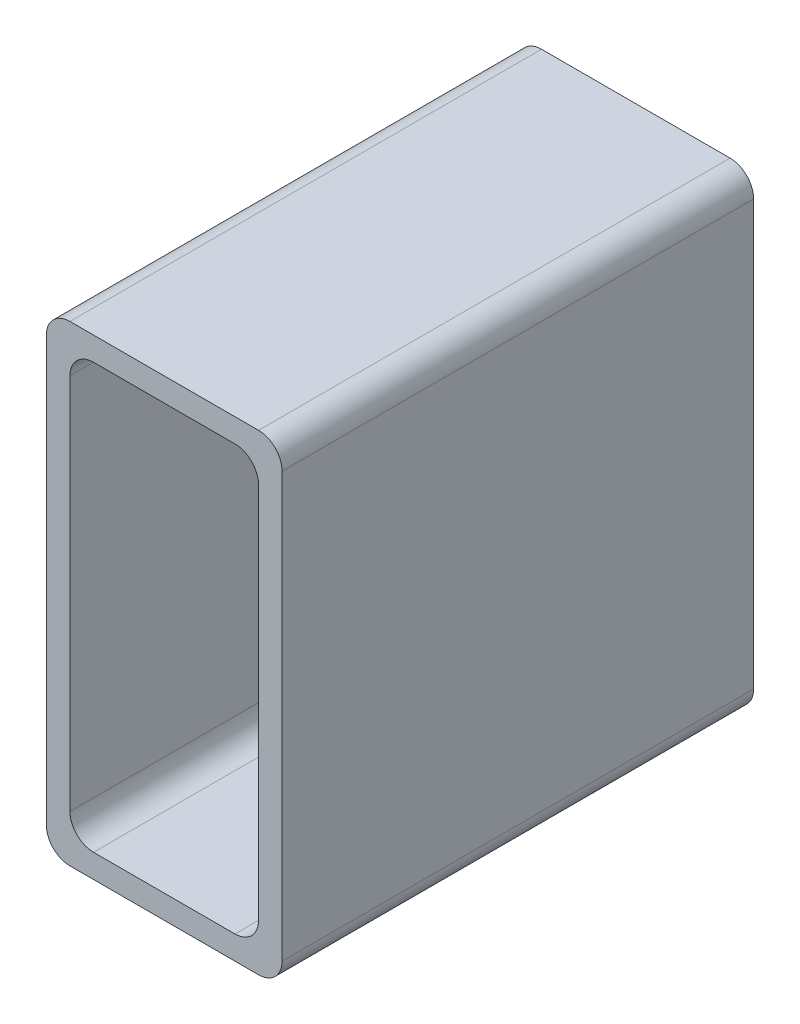
ISO-10303-21;
HEADER;
FILE_DESCRIPTION(('STEP AP214'),'2;1');
FILE_NAME('part.step','',(''),(''),'','','');
FILE_SCHEMA(('AUTOMOTIVE_DESIGN { 1 0 10303 214 1 1 1 1 }'));
ENDSEC;
DATA;
#1=APPLICATION_CONTEXT('core data for automotive mechanical design processes');
#2=APPLICATION_PROTOCOL_DEFINITION('international standard','automotive_design',2000,#1);
#3=PRODUCT_CONTEXT('',#1,'mechanical');
#4=PRODUCT('Part','Part','',(#3));
#5=PRODUCT_RELATED_PRODUCT_CATEGORY('part','',(#4));
#6=PRODUCT_DEFINITION_FORMATION('','',#4);
#7=PRODUCT_DEFINITION_CONTEXT('part definition',#1,'design');
#8=PRODUCT_DEFINITION('design','',#6,#7);
#9=PRODUCT_DEFINITION_SHAPE('','',#8);
#10=(LENGTH_UNIT() NAMED_UNIT(*) SI_UNIT(.MILLI.,.METRE.));
#11=(NAMED_UNIT(*) PLANE_ANGLE_UNIT() SI_UNIT($,.RADIAN.));
#12=(NAMED_UNIT(*) SI_UNIT($,.STERADIAN.) SOLID_ANGLE_UNIT());
#13=UNCERTAINTY_MEASURE_WITH_UNIT(LENGTH_MEASURE(1.E-05),#10,'distance_accuracy_value','');
#14=(GEOMETRIC_REPRESENTATION_CONTEXT(3) GLOBAL_UNCERTAINTY_ASSIGNED_CONTEXT((#13)) GLOBAL_UNIT_ASSIGNED_CONTEXT((#10,
#11,#12)) REPRESENTATION_CONTEXT('',''));
#15=CARTESIAN_POINT('',(0.,0.,0.));
#16=DIRECTION('',(0.,0.,1.));
#17=DIRECTION('',(1.,0.,0.));
#18=AXIS2_PLACEMENT_3D('',#15,#16,#17);
#19=CARTESIAN_POINT('',(12.,-27.,60.));
#20=DIRECTION('',(0.,0.,1.));
#21=DIRECTION('',(1.,0.,0.));
#22=AXIS2_PLACEMENT_3D('',#19,#20,#21);
#23=PLANE('',#22);
#24=CARTESIAN_POINT('',(12.,-27.,60.));
#25=DIRECTION('',(0.,0.,1.));
#26=DIRECTION('',(1.,0.,0.));
#27=AXIS2_PLACEMENT_3D('',#24,#25,#26);
#28=CIRCLE('',#27,3.);
#29=CARTESIAN_POINT('',(12.,-30.,60.));
#30=VERTEX_POINT('',#29);
#31=CARTESIAN_POINT('',(15.,-27.,60.));
#32=VERTEX_POINT('',#31);
#33=EDGE_CURVE('E157',#30,#32,#28,.T.);
#34=ORIENTED_EDGE('',*,*,#33,.T.);
#35=DIRECTION('',(0.,1.,0.));
#36=VECTOR('',#35,1.);
#37=CARTESIAN_POINT('',(15.,-27.,60.));
#38=LINE('',#37,#36);
#39=CARTESIAN_POINT('',(15.,27.,60.));
#40=VERTEX_POINT('',#39);
#41=EDGE_CURVE('E146',#32,#40,#38,.T.);
#42=ORIENTED_EDGE('',*,*,#41,.T.);
#43=CARTESIAN_POINT('',(12.,27.,60.));
#44=DIRECTION('',(0.,0.,1.));
#45=DIRECTION('',(-1.,0.,0.));
#46=AXIS2_PLACEMENT_3D('',#43,#44,#45);
#47=CIRCLE('',#46,3.);
#48=CARTESIAN_POINT('',(12.,30.,60.));
#49=VERTEX_POINT('',#48);
#50=EDGE_CURVE('E156',#40,#49,#47,.T.);
#51=ORIENTED_EDGE('',*,*,#50,.T.);
#52=DIRECTION('',(-1.,0.,0.));
#53=VECTOR('',#52,1.);
#54=CARTESIAN_POINT('',(-12.,30.,60.));
#55=LINE('',#54,#53);
#56=CARTESIAN_POINT('',(-12.,30.,60.));
#57=VERTEX_POINT('',#56);
#58=EDGE_CURVE('E241',#49,#57,#55,.T.);
#59=ORIENTED_EDGE('',*,*,#58,.T.);
#60=CARTESIAN_POINT('',(-12.,27.,60.));
#61=DIRECTION('',(0.,0.,1.));
#62=DIRECTION('',(-1.,0.,0.));
#63=AXIS2_PLACEMENT_3D('',#60,#61,#62);
#64=CIRCLE('',#63,3.);
#65=CARTESIAN_POINT('',(-15.,27.,60.));
#66=VERTEX_POINT('',#65);
#67=EDGE_CURVE('E243',#57,#66,#64,.T.);
#68=ORIENTED_EDGE('',*,*,#67,.T.);
#69=DIRECTION('',(0.,-1.,0.));
#70=VECTOR('',#69,1.);
#71=CARTESIAN_POINT('',(-15.,-27.,60.));
#72=LINE('',#71,#70);
#73=CARTESIAN_POINT('',(-15.,-27.,60.));
#74=VERTEX_POINT('',#73);
#75=EDGE_CURVE('E245',#66,#74,#72,.T.);
#76=ORIENTED_EDGE('',*,*,#75,.T.);
#77=CARTESIAN_POINT('',(-12.,-27.,60.));
#78=DIRECTION('',(0.,0.,1.));
#79=DIRECTION('',(-1.,0.,0.));
#80=AXIS2_PLACEMENT_3D('',#77,#78,#79);
#81=CIRCLE('',#80,3.);
#82=CARTESIAN_POINT('',(-12.,-30.,60.));
#83=VERTEX_POINT('',#82);
#84=EDGE_CURVE('E247',#74,#83,#81,.T.);
#85=ORIENTED_EDGE('',*,*,#84,.T.);
#86=DIRECTION('',(1.,0.,0.));
#87=VECTOR('',#86,1.);
#88=CARTESIAN_POINT('',(-12.,-30.,60.));
#89=LINE('',#88,#87);
#90=EDGE_CURVE('E161',#83,#30,#89,.T.);
#91=ORIENTED_EDGE('',*,*,#90,.T.);
#92=EDGE_LOOP('',(#34,#42,#51,#59,#68,#76,#85,#91));
#93=FACE_BOUND('',#92,.T.);
#94=DIRECTION('',(1.,0.,0.));
#95=VECTOR('',#94,1.);
#96=CARTESIAN_POINT('',(-12.,-27.,60.));
#97=LINE('',#96,#95);
#98=CARTESIAN_POINT('',(-8.99999999999998,-27.,60.));
#99=VERTEX_POINT('',#98);
#100=CARTESIAN_POINT('',(9.,-27.,60.));
#101=VERTEX_POINT('',#100);
#102=EDGE_CURVE('E225',#99,#101,#97,.T.);
#103=ORIENTED_EDGE('',*,*,#102,.F.);
#104=CARTESIAN_POINT('',(-8.99999999999998,-24.,60.));
#105=DIRECTION('',(0.,0.,1.));
#106=DIRECTION('',(1.,0.,0.));
#107=AXIS2_PLACEMENT_3D('',#104,#105,#106);
#108=CIRCLE('',#107,3.);
#109=CARTESIAN_POINT('',(-12.,-24.,60.));
#110=VERTEX_POINT('',#109);
#111=EDGE_CURVE('E11',#99,#110,#108,.F.);
#112=ORIENTED_EDGE('',*,*,#111,.T.);
#113=DIRECTION('',(0.,-1.,0.));
#114=VECTOR('',#113,1.);
#115=CARTESIAN_POINT('',(-12.,-27.,60.));
#116=LINE('',#115,#114);
#117=CARTESIAN_POINT('',(-12.,24.,60.));
#118=VERTEX_POINT('',#117);
#119=EDGE_CURVE('E223',#118,#110,#116,.T.);
#120=ORIENTED_EDGE('',*,*,#119,.F.);
#121=CARTESIAN_POINT('',(-9.,24.,60.));
#122=DIRECTION('',(0.,0.,1.));
#123=DIRECTION('',(1.,0.,0.));
#124=AXIS2_PLACEMENT_3D('',#121,#122,#123);
#125=CIRCLE('',#124,3.);
#126=CARTESIAN_POINT('',(-9.,27.,60.));
#127=VERTEX_POINT('',#126);
#128=EDGE_CURVE('E204',#118,#127,#125,.F.);
#129=ORIENTED_EDGE('',*,*,#128,.T.);
#130=DIRECTION('',(-1.,0.,0.));
#131=VECTOR('',#130,1.);
#132=CARTESIAN_POINT('',(-12.,27.,60.));
#133=LINE('',#132,#131);
#134=CARTESIAN_POINT('',(8.99999999999998,27.,60.));
#135=VERTEX_POINT('',#134);
#136=EDGE_CURVE('E234',#135,#127,#133,.T.);
#137=ORIENTED_EDGE('',*,*,#136,.F.);
#138=CARTESIAN_POINT('',(8.99999999999998,24.,60.));
#139=DIRECTION('',(0.,0.,1.));
#140=DIRECTION('',(1.,0.,0.));
#141=AXIS2_PLACEMENT_3D('',#138,#139,#140);
#142=CIRCLE('',#141,3.);
#143=CARTESIAN_POINT('',(12.,24.,60.));
#144=VERTEX_POINT('',#143);
#145=EDGE_CURVE('E200',#135,#144,#142,.F.);
#146=ORIENTED_EDGE('',*,*,#145,.T.);
#147=DIRECTION('',(0.,1.,0.));
#148=VECTOR('',#147,1.);
#149=CARTESIAN_POINT('',(12.,-27.,60.));
#150=LINE('',#149,#148);
#151=CARTESIAN_POINT('',(12.,-24.,60.));
#152=VERTEX_POINT('',#151);
#153=EDGE_CURVE('E228',#152,#144,#150,.T.);
#154=ORIENTED_EDGE('',*,*,#153,.F.);
#155=CARTESIAN_POINT('',(9.,-24.,60.));
#156=DIRECTION('',(0.,0.,1.));
#157=DIRECTION('',(1.,0.,0.));
#158=AXIS2_PLACEMENT_3D('',#155,#156,#157);
#159=CIRCLE('',#158,3.);
#160=EDGE_CURVE('E196',#152,#101,#159,.F.);
#161=ORIENTED_EDGE('',*,*,#160,.T.);
#162=EDGE_LOOP('',(#103,#112,#120,#129,#137,#146,#154,#161));
#163=FACE_BOUND('',#162,.T.);
#164=ADVANCED_FACE('F33',(#93,#163),#23,.T.);
#165=CARTESIAN_POINT('',(12.,-27.,0.));
#166=DIRECTION('',(0.,0.,1.));
#167=DIRECTION('',(1.,0.,0.));
#168=AXIS2_PLACEMENT_3D('',#165,#166,#167);
#169=PLANE('',#168);
#170=CARTESIAN_POINT('',(12.,-27.,0.));
#171=DIRECTION('',(0.,0.,1.));
#172=DIRECTION('',(1.,0.,0.));
#173=AXIS2_PLACEMENT_3D('',#170,#171,#172);
#174=CIRCLE('',#173,3.);
#175=CARTESIAN_POINT('',(12.,-30.,0.));
#176=VERTEX_POINT('',#175);
#177=CARTESIAN_POINT('',(15.,-27.,0.));
#178=VERTEX_POINT('',#177);
#179=EDGE_CURVE('E169',#176,#178,#174,.T.);
#180=ORIENTED_EDGE('',*,*,#179,.F.);
#181=DIRECTION('',(1.,0.,0.));
#182=VECTOR('',#181,1.);
#183=CARTESIAN_POINT('',(-12.,-30.,0.));
#184=LINE('',#183,#182);
#185=CARTESIAN_POINT('',(-12.,-30.,0.));
#186=VERTEX_POINT('',#185);
#187=EDGE_CURVE('E165',#186,#176,#184,.T.);
#188=ORIENTED_EDGE('',*,*,#187,.F.);
#189=CARTESIAN_POINT('',(-12.,-27.,0.));
#190=DIRECTION('',(0.,0.,1.));
#191=DIRECTION('',(-1.,0.,0.));
#192=AXIS2_PLACEMENT_3D('',#189,#190,#191);
#193=CIRCLE('',#192,3.);
#194=CARTESIAN_POINT('',(-15.,-27.,0.));
#195=VERTEX_POINT('',#194);
#196=EDGE_CURVE('E262',#195,#186,#193,.T.);
#197=ORIENTED_EDGE('',*,*,#196,.F.);
#198=DIRECTION('',(0.,-1.,0.));
#199=VECTOR('',#198,1.);
#200=CARTESIAN_POINT('',(-15.,-27.,0.));
#201=LINE('',#200,#199);
#202=CARTESIAN_POINT('',(-15.,27.,0.));
#203=VERTEX_POINT('',#202);
#204=EDGE_CURVE('E260',#203,#195,#201,.T.);
#205=ORIENTED_EDGE('',*,*,#204,.F.);
#206=CARTESIAN_POINT('',(-12.,27.,0.));
#207=DIRECTION('',(0.,0.,1.));
#208=DIRECTION('',(-1.,0.,0.));
#209=AXIS2_PLACEMENT_3D('',#206,#207,#208);
#210=CIRCLE('',#209,3.);
#211=CARTESIAN_POINT('',(-12.,30.,0.));
#212=VERTEX_POINT('',#211);
#213=EDGE_CURVE('E258',#212,#203,#210,.T.);
#214=ORIENTED_EDGE('',*,*,#213,.F.);
#215=DIRECTION('',(-1.,0.,0.));
#216=VECTOR('',#215,1.);
#217=CARTESIAN_POINT('',(-12.,30.,0.));
#218=LINE('',#217,#216);
#219=CARTESIAN_POINT('',(12.,30.,0.));
#220=VERTEX_POINT('',#219);
#221=EDGE_CURVE('E256',#220,#212,#218,.T.);
#222=ORIENTED_EDGE('',*,*,#221,.F.);
#223=CARTESIAN_POINT('',(12.,27.,0.));
#224=DIRECTION('',(0.,0.,1.));
#225=DIRECTION('',(-1.,0.,0.));
#226=AXIS2_PLACEMENT_3D('',#223,#224,#225);
#227=CIRCLE('',#226,3.);
#228=CARTESIAN_POINT('',(15.,27.,0.));
#229=VERTEX_POINT('',#228);
#230=EDGE_CURVE('E254',#229,#220,#227,.T.);
#231=ORIENTED_EDGE('',*,*,#230,.F.);
#232=DIRECTION('',(0.,1.,0.));
#233=VECTOR('',#232,1.);
#234=CARTESIAN_POINT('',(15.,-27.,0.));
#235=LINE('',#234,#233);
#236=EDGE_CURVE('E252',#178,#229,#235,.T.);
#237=ORIENTED_EDGE('',*,*,#236,.F.);
#238=EDGE_LOOP('',(#180,#188,#197,#205,#214,#222,#231,#237));
#239=FACE_BOUND('',#238,.T.);
#240=DIRECTION('',(-1.,0.,0.));
#241=VECTOR('',#240,1.);
#242=CARTESIAN_POINT('',(-12.,27.,0.));
#243=LINE('',#242,#241);
#244=CARTESIAN_POINT('',(8.99999999999998,27.,0.));
#245=VERTEX_POINT('',#244);
#246=CARTESIAN_POINT('',(-9.,27.,0.));
#247=VERTEX_POINT('',#246);
#248=EDGE_CURVE('E226',#245,#247,#243,.T.);
#249=ORIENTED_EDGE('',*,*,#248,.T.);
#250=CARTESIAN_POINT('',(-9.,24.,0.));
#251=DIRECTION('',(0.,0.,1.));
#252=DIRECTION('',(1.,0.,0.));
#253=AXIS2_PLACEMENT_3D('',#250,#251,#252);
#254=CIRCLE('',#253,3.);
#255=CARTESIAN_POINT('',(-12.,24.,0.));
#256=VERTEX_POINT('',#255);
#257=EDGE_CURVE('E202',#247,#256,#254,.T.);
#258=ORIENTED_EDGE('',*,*,#257,.T.);
#259=DIRECTION('',(0.,-1.,0.));
#260=VECTOR('',#259,1.);
#261=CARTESIAN_POINT('',(-12.,-27.,0.));
#262=LINE('',#261,#260);
#263=CARTESIAN_POINT('',(-12.,-24.,0.));
#264=VERTEX_POINT('',#263);
#265=EDGE_CURVE('E212',#256,#264,#262,.T.);
#266=ORIENTED_EDGE('',*,*,#265,.T.);
#267=CARTESIAN_POINT('',(-8.99999999999998,-24.,0.));
#268=DIRECTION('',(0.,0.,1.));
#269=DIRECTION('',(1.,0.,0.));
#270=AXIS2_PLACEMENT_3D('',#267,#268,#269);
#271=CIRCLE('',#270,3.);
#272=CARTESIAN_POINT('',(-8.99999999999998,-27.,0.));
#273=VERTEX_POINT('',#272);
#274=EDGE_CURVE('E41',#264,#273,#271,.T.);
#275=ORIENTED_EDGE('',*,*,#274,.T.);
#276=DIRECTION('',(1.,0.,0.));
#277=VECTOR('',#276,1.);
#278=CARTESIAN_POINT('',(-12.,-27.,0.));
#279=LINE('',#278,#277);
#280=CARTESIAN_POINT('',(9.,-27.,0.));
#281=VERTEX_POINT('',#280);
#282=EDGE_CURVE('E211',#273,#281,#279,.T.);
#283=ORIENTED_EDGE('',*,*,#282,.T.);
#284=CARTESIAN_POINT('',(9.,-24.,0.));
#285=DIRECTION('',(0.,0.,1.));
#286=DIRECTION('',(1.,0.,0.));
#287=AXIS2_PLACEMENT_3D('',#284,#285,#286);
#288=CIRCLE('',#287,3.);
#289=CARTESIAN_POINT('',(12.,-24.,0.));
#290=VERTEX_POINT('',#289);
#291=EDGE_CURVE('E194',#281,#290,#288,.T.);
#292=ORIENTED_EDGE('',*,*,#291,.T.);
#293=DIRECTION('',(0.,1.,0.));
#294=VECTOR('',#293,1.);
#295=CARTESIAN_POINT('',(12.,-27.,0.));
#296=LINE('',#295,#294);
#297=CARTESIAN_POINT('',(12.,24.,0.));
#298=VERTEX_POINT('',#297);
#299=EDGE_CURVE('E220',#290,#298,#296,.T.);
#300=ORIENTED_EDGE('',*,*,#299,.T.);
#301=CARTESIAN_POINT('',(8.99999999999998,24.,0.));
#302=DIRECTION('',(0.,0.,1.));
#303=DIRECTION('',(1.,0.,0.));
#304=AXIS2_PLACEMENT_3D('',#301,#302,#303);
#305=CIRCLE('',#304,3.);
#306=EDGE_CURVE('E198',#298,#245,#305,.T.);
#307=ORIENTED_EDGE('',*,*,#306,.T.);
#308=EDGE_LOOP('',(#249,#258,#266,#275,#283,#292,#300,#307));
#309=FACE_BOUND('',#308,.T.);
#310=ADVANCED_FACE('F210',(#239,#309),#169,.F.);
#311=CARTESIAN_POINT('',(12.,-27.,60.));
#312=DIRECTION('',(0.,0.,-1.));
#313=DIRECTION('',(-1.,0.,0.));
#314=AXIS2_PLACEMENT_3D('',#311,#312,#313);
#315=CYLINDRICAL_SURFACE('',#314,3.);
#316=ORIENTED_EDGE('',*,*,#179,.T.);
#317=DIRECTION('',(0.,0.,-1.));
#318=VECTOR('',#317,1.);
#319=CARTESIAN_POINT('',(15.,-27.,60.));
#320=LINE('',#319,#318);
#321=EDGE_CURVE('E150',#32,#178,#320,.T.);
#322=ORIENTED_EDGE('',*,*,#321,.F.);
#323=ORIENTED_EDGE('',*,*,#33,.F.);
#324=DIRECTION('',(0.,0.,-1.));
#325=VECTOR('',#324,1.);
#326=CARTESIAN_POINT('',(12.,-30.,60.));
#327=LINE('',#326,#325);
#328=EDGE_CURVE('E250',#30,#176,#327,.T.);
#329=ORIENTED_EDGE('',*,*,#328,.T.);
#330=EDGE_LOOP('',(#316,#322,#323,#329));
#331=FACE_BOUND('',#330,.T.);
#332=ADVANCED_FACE('F167',(#331),#315,.T.);
#333=CARTESIAN_POINT('',(15.,-27.,60.));
#334=DIRECTION('',(-1.,0.,0.));
#335=DIRECTION('',(0.,0.,1.));
#336=AXIS2_PLACEMENT_3D('',#333,#334,#335);
#337=PLANE('',#336);
#338=ORIENTED_EDGE('',*,*,#236,.T.);
#339=DIRECTION('',(0.,0.,-1.));
#340=VECTOR('',#339,1.);
#341=CARTESIAN_POINT('',(15.,27.,60.));
#342=LINE('',#341,#340);
#343=EDGE_CURVE('E153',#40,#229,#342,.T.);
#344=ORIENTED_EDGE('',*,*,#343,.F.);
#345=ORIENTED_EDGE('',*,*,#41,.F.);
#346=ORIENTED_EDGE('',*,*,#321,.T.);
#347=EDGE_LOOP('',(#338,#344,#345,#346));
#348=FACE_BOUND('',#347,.T.);
#349=ADVANCED_FACE('F148',(#348),#337,.F.);
#350=CARTESIAN_POINT('',(12.,27.,60.));
#351=DIRECTION('',(0.,0.,-1.));
#352=DIRECTION('',(-1.,0.,0.));
#353=AXIS2_PLACEMENT_3D('',#350,#351,#352);
#354=CYLINDRICAL_SURFACE('',#353,3.);
#355=ORIENTED_EDGE('',*,*,#230,.T.);
#356=DIRECTION('',(0.,0.,-1.));
#357=VECTOR('',#356,1.);
#358=CARTESIAN_POINT('',(12.,30.,60.));
#359=LINE('',#358,#357);
#360=EDGE_CURVE('E174',#49,#220,#359,.T.);
#361=ORIENTED_EDGE('',*,*,#360,.F.);
#362=ORIENTED_EDGE('',*,*,#50,.F.);
#363=ORIENTED_EDGE('',*,*,#343,.T.);
#364=EDGE_LOOP('',(#355,#361,#362,#363));
#365=FACE_BOUND('',#364,.T.);
#366=ADVANCED_FACE('F300',(#365),#354,.T.);
#367=CARTESIAN_POINT('',(-12.,30.,60.));
#368=DIRECTION('',(0.,-1.,0.));
#369=DIRECTION('',(0.,0.,-1.));
#370=AXIS2_PLACEMENT_3D('',#367,#368,#369);
#371=PLANE('',#370);
#372=ORIENTED_EDGE('',*,*,#221,.T.);
#373=DIRECTION('',(0.,0.,-1.));
#374=VECTOR('',#373,1.);
#375=CARTESIAN_POINT('',(-12.,30.,60.));
#376=LINE('',#375,#374);
#377=EDGE_CURVE('E275',#57,#212,#376,.T.);
#378=ORIENTED_EDGE('',*,*,#377,.F.);
#379=ORIENTED_EDGE('',*,*,#58,.F.);
#380=ORIENTED_EDGE('',*,*,#360,.T.);
#381=EDGE_LOOP('',(#372,#378,#379,#380));
#382=FACE_BOUND('',#381,.T.);
#383=ADVANCED_FACE('F282',(#382),#371,.F.);
#384=CARTESIAN_POINT('',(-12.,27.,60.));
#385=DIRECTION('',(0.,0.,-1.));
#386=DIRECTION('',(-1.,0.,0.));
#387=AXIS2_PLACEMENT_3D('',#384,#385,#386);
#388=CYLINDRICAL_SURFACE('',#387,3.);
#389=ORIENTED_EDGE('',*,*,#213,.T.);
#390=DIRECTION('',(0.,0.,-1.));
#391=VECTOR('',#390,1.);
#392=CARTESIAN_POINT('',(-15.,27.,60.));
#393=LINE('',#392,#391);
#394=EDGE_CURVE('E272',#66,#203,#393,.T.);
#395=ORIENTED_EDGE('',*,*,#394,.F.);
#396=ORIENTED_EDGE('',*,*,#67,.F.);
#397=ORIENTED_EDGE('',*,*,#377,.T.);
#398=EDGE_LOOP('',(#389,#395,#396,#397));
#399=FACE_BOUND('',#398,.T.);
#400=ADVANCED_FACE('F292',(#399),#388,.T.);
#401=CARTESIAN_POINT('',(-15.,-27.,60.));
#402=DIRECTION('',(1.,0.,0.));
#403=DIRECTION('',(0.,0.,-1.));
#404=AXIS2_PLACEMENT_3D('',#401,#402,#403);
#405=PLANE('',#404);
#406=ORIENTED_EDGE('',*,*,#204,.T.);
#407=DIRECTION('',(0.,0.,-1.));
#408=VECTOR('',#407,1.);
#409=CARTESIAN_POINT('',(-15.,-27.,60.));
#410=LINE('',#409,#408);
#411=EDGE_CURVE('E269',#74,#195,#410,.T.);
#412=ORIENTED_EDGE('',*,*,#411,.F.);
#413=ORIENTED_EDGE('',*,*,#75,.F.);
#414=ORIENTED_EDGE('',*,*,#394,.T.);
#415=EDGE_LOOP('',(#406,#412,#413,#414));
#416=FACE_BOUND('',#415,.T.);
#417=ADVANCED_FACE('F296',(#416),#405,.F.);
#418=CARTESIAN_POINT('',(-12.,-27.,60.));
#419=DIRECTION('',(0.,0.,-1.));
#420=DIRECTION('',(-1.,0.,0.));
#421=AXIS2_PLACEMENT_3D('',#418,#419,#420);
#422=CYLINDRICAL_SURFACE('',#421,3.);
#423=ORIENTED_EDGE('',*,*,#196,.T.);
#424=DIRECTION('',(0.,0.,-1.));
#425=VECTOR('',#424,1.);
#426=CARTESIAN_POINT('',(-12.,-30.,60.));
#427=LINE('',#426,#425);
#428=EDGE_CURVE('E266',#83,#186,#427,.T.);
#429=ORIENTED_EDGE('',*,*,#428,.F.);
#430=ORIENTED_EDGE('',*,*,#84,.F.);
#431=ORIENTED_EDGE('',*,*,#411,.T.);
#432=EDGE_LOOP('',(#423,#429,#430,#431));
#433=FACE_BOUND('',#432,.T.);
#434=ADVANCED_FACE('F321',(#433),#422,.T.);
#435=CARTESIAN_POINT('',(-12.,-30.,60.));
#436=DIRECTION('',(0.,1.,0.));
#437=DIRECTION('',(0.,0.,1.));
#438=AXIS2_PLACEMENT_3D('',#435,#436,#437);
#439=PLANE('',#438);
#440=ORIENTED_EDGE('',*,*,#187,.T.);
#441=ORIENTED_EDGE('',*,*,#328,.F.);
#442=ORIENTED_EDGE('',*,*,#90,.F.);
#443=ORIENTED_EDGE('',*,*,#428,.T.);
#444=EDGE_LOOP('',(#440,#441,#442,#443));
#445=FACE_BOUND('',#444,.T.);
#446=ADVANCED_FACE('F318',(#445),#439,.F.);
#447=CARTESIAN_POINT('',(-12.,-27.,60.));
#448=DIRECTION('',(1.,0.,0.));
#449=DIRECTION('',(0.,1.,0.));
#450=AXIS2_PLACEMENT_3D('',#447,#448,#449);
#451=PLANE('',#450);
#452=ORIENTED_EDGE('',*,*,#265,.F.);
#453=DIRECTION('',(0.,0.,-1.));
#454=VECTOR('',#453,1.);
#455=CARTESIAN_POINT('',(-12.,24.,60.));
#456=LINE('',#455,#454);
#457=EDGE_CURVE('E53',#256,#118,#456,.F.);
#458=ORIENTED_EDGE('',*,*,#457,.T.);
#459=ORIENTED_EDGE('',*,*,#119,.T.);
#460=DIRECTION('',(0.,0.,-1.));
#461=VECTOR('',#460,1.);
#462=CARTESIAN_POINT('',(-12.,-24.,0.));
#463=LINE('',#462,#461);
#464=EDGE_CURVE('E190',#110,#264,#463,.T.);
#465=ORIENTED_EDGE('',*,*,#464,.T.);
#466=EDGE_LOOP('',(#452,#458,#459,#465));
#467=FACE_BOUND('',#466,.T.);
#468=ADVANCED_FACE('F222',(#467),#451,.T.);
#469=CARTESIAN_POINT('',(-12.,-27.,60.));
#470=DIRECTION('',(0.,1.,0.));
#471=DIRECTION('',(-1.,0.,0.));
#472=AXIS2_PLACEMENT_3D('',#469,#470,#471);
#473=PLANE('',#472);
#474=ORIENTED_EDGE('',*,*,#102,.T.);
#475=DIRECTION('',(0.,0.,-1.));
#476=VECTOR('',#475,1.);
#477=CARTESIAN_POINT('',(9.,-27.,0.));
#478=LINE('',#477,#476);
#479=EDGE_CURVE('E172',#101,#281,#478,.T.);
#480=ORIENTED_EDGE('',*,*,#479,.T.);
#481=ORIENTED_EDGE('',*,*,#282,.F.);
#482=DIRECTION('',(0.,0.,-1.));
#483=VECTOR('',#482,1.);
#484=CARTESIAN_POINT('',(-8.99999999999998,-27.,60.));
#485=LINE('',#484,#483);
#486=EDGE_CURVE('E170',#273,#99,#485,.F.);
#487=ORIENTED_EDGE('',*,*,#486,.T.);
#488=EDGE_LOOP('',(#474,#480,#481,#487));
#489=FACE_BOUND('',#488,.T.);
#490=ADVANCED_FACE('F218',(#489),#473,.T.);
#491=CARTESIAN_POINT('',(12.,-27.,60.));
#492=DIRECTION('',(-1.,0.,0.));
#493=DIRECTION('',(0.,-1.,0.));
#494=AXIS2_PLACEMENT_3D('',#491,#492,#493);
#495=PLANE('',#494);
#496=ORIENTED_EDGE('',*,*,#299,.F.);
#497=DIRECTION('',(0.,0.,-1.));
#498=VECTOR('',#497,1.);
#499=CARTESIAN_POINT('',(12.,-24.,60.));
#500=LINE('',#499,#498);
#501=EDGE_CURVE('E183',#290,#152,#500,.F.);
#502=ORIENTED_EDGE('',*,*,#501,.T.);
#503=ORIENTED_EDGE('',*,*,#153,.T.);
#504=DIRECTION('',(0.,0.,-1.));
#505=VECTOR('',#504,1.);
#506=CARTESIAN_POINT('',(12.,24.,0.));
#507=LINE('',#506,#505);
#508=EDGE_CURVE('E180',#144,#298,#507,.T.);
#509=ORIENTED_EDGE('',*,*,#508,.T.);
#510=EDGE_LOOP('',(#496,#502,#503,#509));
#511=FACE_BOUND('',#510,.T.);
#512=ADVANCED_FACE('F357',(#511),#495,.T.);
#513=CARTESIAN_POINT('',(-12.,27.,60.));
#514=DIRECTION('',(0.,-1.,0.));
#515=DIRECTION('',(0.,0.,-1.));
#516=AXIS2_PLACEMENT_3D('',#513,#514,#515);
#517=PLANE('',#516);
#518=ORIENTED_EDGE('',*,*,#248,.F.);
#519=DIRECTION('',(0.,0.,-1.));
#520=VECTOR('',#519,1.);
#521=CARTESIAN_POINT('',(8.99999999999998,27.,60.));
#522=LINE('',#521,#520);
#523=EDGE_CURVE('E188',#245,#135,#522,.F.);
#524=ORIENTED_EDGE('',*,*,#523,.T.);
#525=ORIENTED_EDGE('',*,*,#136,.T.);
#526=DIRECTION('',(0.,0.,-1.));
#527=VECTOR('',#526,1.);
#528=CARTESIAN_POINT('',(-9.,27.,0.));
#529=LINE('',#528,#527);
#530=EDGE_CURVE('E185',#127,#247,#529,.T.);
#531=ORIENTED_EDGE('',*,*,#530,.T.);
#532=EDGE_LOOP('',(#518,#524,#525,#531));
#533=FACE_BOUND('',#532,.T.);
#534=ADVANCED_FACE('F363',(#533),#517,.T.);
#535=CARTESIAN_POINT('',(9.,-24.,60.));
#536=DIRECTION('',(0.,0.,1.));
#537=DIRECTION('',(1.,0.,0.));
#538=AXIS2_PLACEMENT_3D('',#535,#536,#537);
#539=CYLINDRICAL_SURFACE('',#538,3.);
#540=ORIENTED_EDGE('',*,*,#160,.F.);
#541=ORIENTED_EDGE('',*,*,#501,.F.);
#542=ORIENTED_EDGE('',*,*,#291,.F.);
#543=ORIENTED_EDGE('',*,*,#479,.F.);
#544=EDGE_LOOP('',(#540,#541,#542,#543));
#545=FACE_BOUND('',#544,.T.);
#546=ADVANCED_FACE('F371',(#545),#539,.F.);
#547=CARTESIAN_POINT('',(8.99999999999998,24.,60.));
#548=DIRECTION('',(0.,0.,1.));
#549=DIRECTION('',(1.,0.,0.));
#550=AXIS2_PLACEMENT_3D('',#547,#548,#549);
#551=CYLINDRICAL_SURFACE('',#550,3.);
#552=ORIENTED_EDGE('',*,*,#145,.F.);
#553=ORIENTED_EDGE('',*,*,#523,.F.);
#554=ORIENTED_EDGE('',*,*,#306,.F.);
#555=ORIENTED_EDGE('',*,*,#508,.F.);
#556=EDGE_LOOP('',(#552,#553,#554,#555));
#557=FACE_BOUND('',#556,.T.);
#558=ADVANCED_FACE('F379',(#557),#551,.F.);
#559=CARTESIAN_POINT('',(-9.,24.,60.));
#560=DIRECTION('',(0.,0.,1.));
#561=DIRECTION('',(1.,0.,0.));
#562=AXIS2_PLACEMENT_3D('',#559,#560,#561);
#563=CYLINDRICAL_SURFACE('',#562,3.);
#564=ORIENTED_EDGE('',*,*,#128,.F.);
#565=ORIENTED_EDGE('',*,*,#457,.F.);
#566=ORIENTED_EDGE('',*,*,#257,.F.);
#567=ORIENTED_EDGE('',*,*,#530,.F.);
#568=EDGE_LOOP('',(#564,#565,#566,#567));
#569=FACE_BOUND('',#568,.T.);
#570=ADVANCED_FACE('F387',(#569),#563,.F.);
#571=CARTESIAN_POINT('',(-8.99999999999998,-24.,60.));
#572=DIRECTION('',(0.,0.,1.));
#573=DIRECTION('',(1.,0.,0.));
#574=AXIS2_PLACEMENT_3D('',#571,#572,#573);
#575=CYLINDRICAL_SURFACE('',#574,3.);
#576=ORIENTED_EDGE('',*,*,#111,.F.);
#577=ORIENTED_EDGE('',*,*,#486,.F.);
#578=ORIENTED_EDGE('',*,*,#274,.F.);
#579=ORIENTED_EDGE('',*,*,#464,.F.);
#580=EDGE_LOOP('',(#576,#577,#578,#579));
#581=FACE_BOUND('',#580,.T.);
#582=ADVANCED_FACE('F35',(#581),#575,.F.);
#583=CLOSED_SHELL('',(#164,#310,#332,#349,#366,#383,#400,#417,#434,#446,#468,#490,#512,#534,
#546,#558,#570,#582));
#584=MANIFOLD_SOLID_BREP('B2',#583);
#585=ADVANCED_BREP_SHAPE_REPRESENTATION('',(#18,#584),#14);
#586=SHAPE_DEFINITION_REPRESENTATION(#9,#585);
ENDSEC;
END-ISO-10303-21;
